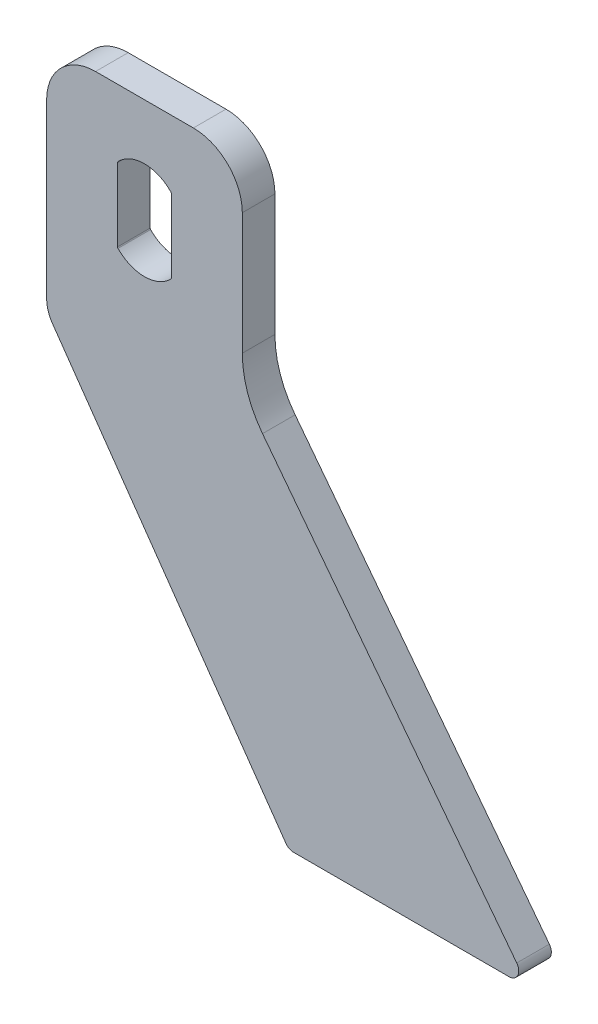
ISO-10303-21;
HEADER;
FILE_DESCRIPTION(('STEP AP214'),'2;1');
FILE_NAME('part.step','',(''),(''),'','','');
FILE_SCHEMA(('AUTOMOTIVE_DESIGN { 1 0 10303 214 1 1 1 1 }'));
ENDSEC;
DATA;
#1=APPLICATION_CONTEXT('core data for automotive mechanical design processes');
#2=APPLICATION_PROTOCOL_DEFINITION('international standard','automotive_design',2000,#1);
#3=PRODUCT_CONTEXT('',#1,'mechanical');
#4=PRODUCT('Part','Part','',(#3));
#5=PRODUCT_RELATED_PRODUCT_CATEGORY('part','',(#4));
#6=PRODUCT_DEFINITION_FORMATION('','',#4);
#7=PRODUCT_DEFINITION_CONTEXT('part definition',#1,'design');
#8=PRODUCT_DEFINITION('design','',#6,#7);
#9=PRODUCT_DEFINITION_SHAPE('','',#8);
#10=(LENGTH_UNIT() NAMED_UNIT(*) SI_UNIT(.MILLI.,.METRE.));
#11=(NAMED_UNIT(*) PLANE_ANGLE_UNIT() SI_UNIT($,.RADIAN.));
#12=(NAMED_UNIT(*) SI_UNIT($,.STERADIAN.) SOLID_ANGLE_UNIT());
#13=UNCERTAINTY_MEASURE_WITH_UNIT(LENGTH_MEASURE(1.E-05),#10,'distance_accuracy_value','');
#14=(GEOMETRIC_REPRESENTATION_CONTEXT(3) GLOBAL_UNCERTAINTY_ASSIGNED_CONTEXT((#13)) GLOBAL_UNIT_ASSIGNED_CONTEXT((#10,
#11,#12)) REPRESENTATION_CONTEXT('',''));
#15=CARTESIAN_POINT('',(0.,0.,0.));
#16=DIRECTION('',(0.,0.,1.));
#17=DIRECTION('',(1.,0.,0.));
#18=AXIS2_PLACEMENT_3D('',#15,#16,#17);
#19=CARTESIAN_POINT('',(-15.,17.,10.));
#20=DIRECTION('',(0.,0.,1.));
#21=DIRECTION('',(1.,0.,0.));
#22=AXIS2_PLACEMENT_3D('',#19,#20,#21);
#23=PLANE('',#22);
#24=CARTESIAN_POINT('',(-15.,17.,10.));
#25=DIRECTION('',(0.,0.,1.));
#26=DIRECTION('',(1.,0.,0.));
#27=AXIS2_PLACEMENT_3D('',#24,#25,#26);
#28=CIRCLE('',#27,15.);
#29=CARTESIAN_POINT('',(-15.,32.,10.));
#30=VERTEX_POINT('',#29);
#31=CARTESIAN_POINT('',(-30.,17.,10.));
#32=VERTEX_POINT('',#31);
#33=EDGE_CURVE('E238',#30,#32,#28,.T.);
#34=ORIENTED_EDGE('',*,*,#33,.T.);
#35=DIRECTION('',(0.,-1.,0.));
#36=VECTOR('',#35,1.);
#37=CARTESIAN_POINT('',(-30.,17.,10.));
#38=LINE('',#37,#36);
#39=CARTESIAN_POINT('',(-30.,-35.8470121112102,10.));
#40=VERTEX_POINT('',#39);
#41=EDGE_CURVE('E241',#32,#40,#38,.T.);
#42=ORIENTED_EDGE('',*,*,#41,.T.);
#43=CARTESIAN_POINT('',(-20.,-35.8470121112102,10.));
#44=DIRECTION('',(0.,0.,1.));
#45=DIRECTION('',(1.,0.,0.));
#46=AXIS2_PLACEMENT_3D('',#43,#44,#45);
#47=CIRCLE('',#46,10.);
#48=CARTESIAN_POINT('',(-28.1915204428899,-41.5827764747206,10.));
#49=VERTEX_POINT('',#48);
#50=EDGE_CURVE('E244',#40,#49,#47,.T.);
#51=ORIENTED_EDGE('',*,*,#50,.T.);
#52=DIRECTION('',(0.573576436351047,-0.819152044288991,0.));
#53=VECTOR('',#52,1.);
#54=CARTESIAN_POINT('',(-28.1915204428899,-41.5827764747206,10.));
#55=LINE('',#54,#53);
#56=CARTESIAN_POINT('',(43.3262440690177,-143.720729309053,10.));
#57=VERTEX_POINT('',#56);
#58=EDGE_CURVE('E246',#49,#57,#55,.T.);
#59=ORIENTED_EDGE('',*,*,#58,.T.);
#60=CARTESIAN_POINT('',(45.7837002018847,-142.,10.));
#61=DIRECTION('',(0.,0.,1.));
#62=DIRECTION('',(-1.,0.,0.));
#63=AXIS2_PLACEMENT_3D('',#60,#61,#62);
#64=CIRCLE('',#63,3.);
#65=CARTESIAN_POINT('',(45.7837002018847,-145.,10.));
#66=VERTEX_POINT('',#65);
#67=EDGE_CURVE('E248',#57,#66,#64,.T.);
#68=ORIENTED_EDGE('',*,*,#67,.T.);
#69=DIRECTION('',(1.,0.,0.));
#70=VECTOR('',#69,1.);
#71=CARTESIAN_POINT('',(45.7837002018847,-145.,10.));
#72=LINE('',#71,#70);
#73=CARTESIAN_POINT('',(111.775541917624,-145.,10.));
#74=VERTEX_POINT('',#73);
#75=EDGE_CURVE('E250',#66,#74,#72,.T.);
#76=ORIENTED_EDGE('',*,*,#75,.T.);
#77=CARTESIAN_POINT('',(111.775541917624,-142.,10.));
#78=DIRECTION('',(0.,0.,1.));
#79=DIRECTION('',(1.,0.,0.));
#80=AXIS2_PLACEMENT_3D('',#77,#78,#79);
#81=CIRCLE('',#80,3.);
#82=CARTESIAN_POINT('',(114.155601938497,-140.173715712974,10.));
#83=VERTEX_POINT('',#82);
#84=EDGE_CURVE('E252',#74,#83,#81,.T.);
#85=ORIENTED_EDGE('',*,*,#84,.T.);
#86=DIRECTION('',(-0.608761429008722,0.793353340291234,0.));
#87=VECTOR('',#86,1.);
#88=CARTESIAN_POINT('',(36.199399791263,-38.5792151043604,10.));
#89=LINE('',#88,#87);
#90=CARTESIAN_POINT('',(36.199399791263,-38.5792151043604,10.));
#91=VERTEX_POINT('',#90);
#92=EDGE_CURVE('E254',#83,#91,#89,.T.);
#93=ORIENTED_EDGE('',*,*,#92,.T.);
#94=CARTESIAN_POINT('',(60.,-20.3163722340987,10.));
#95=DIRECTION('',(0.,0.,-1.));
#96=DIRECTION('',(1.,0.,0.));
#97=AXIS2_PLACEMENT_3D('',#94,#95,#96);
#98=CIRCLE('',#97,30.);
#99=CARTESIAN_POINT('',(30.,-20.3163722340987,10.));
#100=VERTEX_POINT('',#99);
#101=EDGE_CURVE('E256',#91,#100,#98,.T.);
#102=ORIENTED_EDGE('',*,*,#101,.T.);
#103=DIRECTION('',(0.,1.,0.));
#104=VECTOR('',#103,1.);
#105=CARTESIAN_POINT('',(30.,17.,10.));
#106=LINE('',#105,#104);
#107=CARTESIAN_POINT('',(30.,17.,10.));
#108=VERTEX_POINT('',#107);
#109=EDGE_CURVE('E258',#100,#108,#106,.T.);
#110=ORIENTED_EDGE('',*,*,#109,.T.);
#111=CARTESIAN_POINT('',(15.,17.,10.));
#112=DIRECTION('',(0.,0.,1.));
#113=DIRECTION('',(-1.,0.,0.));
#114=AXIS2_PLACEMENT_3D('',#111,#112,#113);
#115=CIRCLE('',#114,15.);
#116=CARTESIAN_POINT('',(15.,32.,10.));
#117=VERTEX_POINT('',#116);
#118=EDGE_CURVE('E260',#108,#117,#115,.T.);
#119=ORIENTED_EDGE('',*,*,#118,.T.);
#120=DIRECTION('',(-1.,0.,0.));
#121=VECTOR('',#120,1.);
#122=CARTESIAN_POINT('',(15.,32.,10.));
#123=LINE('',#122,#121);
#124=EDGE_CURVE('E262',#117,#30,#123,.T.);
#125=ORIENTED_EDGE('',*,*,#124,.T.);
#126=EDGE_LOOP('',(#34,#42,#51,#59,#68,#76,#85,#93,#102,#110,#119,#125));
#127=FACE_BOUND('',#126,.T.);
#128=CARTESIAN_POINT('',(0.,3.75,10.));
#129=DIRECTION('',(0.,0.,1.));
#130=DIRECTION('',(1.,0.,0.));
#131=AXIS2_PLACEMENT_3D('',#128,#129,#130);
#132=CIRCLE('',#131,11.25);
#133=CARTESIAN_POINT('',(8.11046511627907,11.5463360367304,10.));
#134=VERTEX_POINT('',#133);
#135=CARTESIAN_POINT('',(-8.11046511627906,11.5463360367304,10.));
#136=VERTEX_POINT('',#135);
#137=EDGE_CURVE('E181',#134,#136,#132,.T.);
#138=ORIENTED_EDGE('',*,*,#137,.F.);
#139=CARTESIAN_POINT('',(7.75,11.1998322128757,10.));
#140=DIRECTION('',(0.,0.,1.));
#141=DIRECTION('',(1.,0.,0.));
#142=AXIS2_PLACEMENT_3D('',#139,#140,#141);
#143=CIRCLE('',#142,0.500000000000002);
#144=CARTESIAN_POINT('',(8.25,11.1998322128757,10.));
#145=VERTEX_POINT('',#144);
#146=EDGE_CURVE('E173',#145,#134,#143,.T.);
#147=ORIENTED_EDGE('',*,*,#146,.F.);
#148=DIRECTION('',(0.,1.,0.));
#149=VECTOR('',#148,1.);
#150=CARTESIAN_POINT('',(8.25,-11.1998322128757,10.));
#151=LINE('',#150,#149);
#152=CARTESIAN_POINT('',(8.25,-11.1998322128757,10.));
#153=VERTEX_POINT('',#152);
#154=EDGE_CURVE('E206',#153,#145,#151,.T.);
#155=ORIENTED_EDGE('',*,*,#154,.F.);
#156=CARTESIAN_POINT('',(7.75,-11.1998322128757,10.));
#157=DIRECTION('',(0.,0.,1.));
#158=DIRECTION('',(1.,0.,0.));
#159=AXIS2_PLACEMENT_3D('',#156,#157,#158);
#160=CIRCLE('',#159,0.500000000000002);
#161=CARTESIAN_POINT('',(8.11046511627907,-11.5463360367304,10.));
#162=VERTEX_POINT('',#161);
#163=EDGE_CURVE('E204',#162,#153,#160,.T.);
#164=ORIENTED_EDGE('',*,*,#163,.F.);
#165=CARTESIAN_POINT('',(0.,-3.75,10.));
#166=DIRECTION('',(0.,0.,1.));
#167=DIRECTION('',(-1.,0.,0.));
#168=AXIS2_PLACEMENT_3D('',#165,#166,#167);
#169=CIRCLE('',#168,11.25);
#170=CARTESIAN_POINT('',(-8.11046511627906,-11.5463360367304,10.));
#171=VERTEX_POINT('',#170);
#172=EDGE_CURVE('E202',#171,#162,#169,.T.);
#173=ORIENTED_EDGE('',*,*,#172,.F.);
#174=CARTESIAN_POINT('',(-7.75,-11.1998322128757,10.));
#175=DIRECTION('',(0.,0.,1.));
#176=DIRECTION('',(-1.,0.,0.));
#177=AXIS2_PLACEMENT_3D('',#174,#175,#176);
#178=CIRCLE('',#177,0.499999999999999);
#179=CARTESIAN_POINT('',(-8.25,-11.1998322128757,10.));
#180=VERTEX_POINT('',#179);
#181=EDGE_CURVE('E200',#180,#171,#178,.T.);
#182=ORIENTED_EDGE('',*,*,#181,.F.);
#183=DIRECTION('',(0.,-1.,0.));
#184=VECTOR('',#183,1.);
#185=CARTESIAN_POINT('',(-8.25,-11.1998322128757,10.));
#186=LINE('',#185,#184);
#187=CARTESIAN_POINT('',(-8.25,11.1998322128757,10.));
#188=VERTEX_POINT('',#187);
#189=EDGE_CURVE('E196',#188,#180,#186,.T.);
#190=ORIENTED_EDGE('',*,*,#189,.F.);
#191=CARTESIAN_POINT('',(-7.75,11.1998322128757,10.));
#192=DIRECTION('',(0.,0.,1.));
#193=DIRECTION('',(-1.,0.,0.));
#194=AXIS2_PLACEMENT_3D('',#191,#192,#193);
#195=CIRCLE('',#194,0.499999999999999);
#196=EDGE_CURVE('E194',#136,#188,#195,.T.);
#197=ORIENTED_EDGE('',*,*,#196,.F.);
#198=EDGE_LOOP('',(#138,#147,#155,#164,#173,#182,#190,#197));
#199=FACE_BOUND('',#198,.T.);
#200=ADVANCED_FACE('F36',(#127,#199),#23,.T.);
#201=CARTESIAN_POINT('',(-15.,17.,0.));
#202=DIRECTION('',(0.,0.,1.));
#203=DIRECTION('',(1.,0.,0.));
#204=AXIS2_PLACEMENT_3D('',#201,#202,#203);
#205=PLANE('',#204);
#206=CARTESIAN_POINT('',(-15.,17.,0.));
#207=DIRECTION('',(0.,0.,1.));
#208=DIRECTION('',(1.,0.,0.));
#209=AXIS2_PLACEMENT_3D('',#206,#207,#208);
#210=CIRCLE('',#209,15.);
#211=CARTESIAN_POINT('',(-15.,32.,0.));
#212=VERTEX_POINT('',#211);
#213=CARTESIAN_POINT('',(-30.,17.,0.));
#214=VERTEX_POINT('',#213);
#215=EDGE_CURVE('E189',#212,#214,#210,.T.);
#216=ORIENTED_EDGE('',*,*,#215,.F.);
#217=DIRECTION('',(-1.,0.,0.));
#218=VECTOR('',#217,1.);
#219=CARTESIAN_POINT('',(15.,32.,0.));
#220=LINE('',#219,#218);
#221=CARTESIAN_POINT('',(15.,32.,0.));
#222=VERTEX_POINT('',#221);
#223=EDGE_CURVE('E242',#222,#212,#220,.T.);
#224=ORIENTED_EDGE('',*,*,#223,.F.);
#225=CARTESIAN_POINT('',(15.,17.,0.));
#226=DIRECTION('',(0.,0.,1.));
#227=DIRECTION('',(-1.,0.,0.));
#228=AXIS2_PLACEMENT_3D('',#225,#226,#227);
#229=CIRCLE('',#228,15.);
#230=CARTESIAN_POINT('',(30.,17.,0.));
#231=VERTEX_POINT('',#230);
#232=EDGE_CURVE('E285',#231,#222,#229,.T.);
#233=ORIENTED_EDGE('',*,*,#232,.F.);
#234=DIRECTION('',(0.,1.,0.));
#235=VECTOR('',#234,1.);
#236=CARTESIAN_POINT('',(30.,17.,0.));
#237=LINE('',#236,#235);
#238=CARTESIAN_POINT('',(30.,-20.3163722340987,0.));
#239=VERTEX_POINT('',#238);
#240=EDGE_CURVE('E283',#239,#231,#237,.T.);
#241=ORIENTED_EDGE('',*,*,#240,.F.);
#242=CARTESIAN_POINT('',(60.,-20.3163722340987,0.));
#243=DIRECTION('',(0.,0.,-1.));
#244=DIRECTION('',(1.,0.,0.));
#245=AXIS2_PLACEMENT_3D('',#242,#243,#244);
#246=CIRCLE('',#245,30.);
#247=CARTESIAN_POINT('',(36.199399791263,-38.5792151043604,0.));
#248=VERTEX_POINT('',#247);
#249=EDGE_CURVE('E281',#248,#239,#246,.T.);
#250=ORIENTED_EDGE('',*,*,#249,.F.);
#251=DIRECTION('',(-0.608761429008722,0.793353340291234,0.));
#252=VECTOR('',#251,1.);
#253=CARTESIAN_POINT('',(36.199399791263,-38.5792151043604,0.));
#254=LINE('',#253,#252);
#255=CARTESIAN_POINT('',(114.155601938497,-140.173715712974,0.));
#256=VERTEX_POINT('',#255);
#257=EDGE_CURVE('E279',#256,#248,#254,.T.);
#258=ORIENTED_EDGE('',*,*,#257,.F.);
#259=CARTESIAN_POINT('',(111.775541917624,-142.,0.));
#260=DIRECTION('',(0.,0.,1.));
#261=DIRECTION('',(1.,0.,0.));
#262=AXIS2_PLACEMENT_3D('',#259,#260,#261);
#263=CIRCLE('',#262,3.);
#264=CARTESIAN_POINT('',(111.775541917624,-145.,0.));
#265=VERTEX_POINT('',#264);
#266=EDGE_CURVE('E277',#265,#256,#263,.T.);
#267=ORIENTED_EDGE('',*,*,#266,.F.);
#268=DIRECTION('',(1.,0.,0.));
#269=VECTOR('',#268,1.);
#270=CARTESIAN_POINT('',(45.7837002018847,-145.,0.));
#271=LINE('',#270,#269);
#272=CARTESIAN_POINT('',(45.7837002018847,-145.,0.));
#273=VERTEX_POINT('',#272);
#274=EDGE_CURVE('E275',#273,#265,#271,.T.);
#275=ORIENTED_EDGE('',*,*,#274,.F.);
#276=CARTESIAN_POINT('',(45.7837002018847,-142.,0.));
#277=DIRECTION('',(0.,0.,1.));
#278=DIRECTION('',(-1.,0.,0.));
#279=AXIS2_PLACEMENT_3D('',#276,#277,#278);
#280=CIRCLE('',#279,3.);
#281=CARTESIAN_POINT('',(43.3262440690177,-143.720729309053,0.));
#282=VERTEX_POINT('',#281);
#283=EDGE_CURVE('E273',#282,#273,#280,.T.);
#284=ORIENTED_EDGE('',*,*,#283,.F.);
#285=DIRECTION('',(0.573576436351047,-0.819152044288991,0.));
#286=VECTOR('',#285,1.);
#287=CARTESIAN_POINT('',(-28.1915204428899,-41.5827764747206,0.));
#288=LINE('',#287,#286);
#289=CARTESIAN_POINT('',(-28.1915204428899,-41.5827764747206,0.));
#290=VERTEX_POINT('',#289);
#291=EDGE_CURVE('E271',#290,#282,#288,.T.);
#292=ORIENTED_EDGE('',*,*,#291,.F.);
#293=CARTESIAN_POINT('',(-20.,-35.8470121112102,0.));
#294=DIRECTION('',(0.,0.,1.));
#295=DIRECTION('',(1.,0.,0.));
#296=AXIS2_PLACEMENT_3D('',#293,#294,#295);
#297=CIRCLE('',#296,10.);
#298=CARTESIAN_POINT('',(-30.,-35.8470121112102,0.));
#299=VERTEX_POINT('',#298);
#300=EDGE_CURVE('E269',#299,#290,#297,.T.);
#301=ORIENTED_EDGE('',*,*,#300,.F.);
#302=DIRECTION('',(0.,-1.,0.));
#303=VECTOR('',#302,1.);
#304=CARTESIAN_POINT('',(-30.,17.,0.));
#305=LINE('',#304,#303);
#306=EDGE_CURVE('E267',#214,#299,#305,.T.);
#307=ORIENTED_EDGE('',*,*,#306,.F.);
#308=EDGE_LOOP('',(#216,#224,#233,#241,#250,#258,#267,#275,#284,#292,#301,#307));
#309=FACE_BOUND('',#308,.T.);
#310=CARTESIAN_POINT('',(7.75,11.1998322128757,0.));
#311=DIRECTION('',(0.,0.,1.));
#312=DIRECTION('',(1.,0.,0.));
#313=AXIS2_PLACEMENT_3D('',#310,#311,#312);
#314=CIRCLE('',#313,0.500000000000002);
#315=CARTESIAN_POINT('',(8.25,11.1998322128757,0.));
#316=VERTEX_POINT('',#315);
#317=CARTESIAN_POINT('',(8.11046511627907,11.5463360367304,0.));
#318=VERTEX_POINT('',#317);
#319=EDGE_CURVE('E59',#316,#318,#314,.T.);
#320=ORIENTED_EDGE('',*,*,#319,.T.);
#321=CARTESIAN_POINT('',(0.,3.75,0.));
#322=DIRECTION('',(0.,0.,1.));
#323=DIRECTION('',(1.,0.,0.));
#324=AXIS2_PLACEMENT_3D('',#321,#322,#323);
#325=CIRCLE('',#324,11.25);
#326=CARTESIAN_POINT('',(-8.11046511627906,11.5463360367304,0.));
#327=VERTEX_POINT('',#326);
#328=EDGE_CURVE('E188',#318,#327,#325,.T.);
#329=ORIENTED_EDGE('',*,*,#328,.T.);
#330=CARTESIAN_POINT('',(-7.75,11.1998322128757,0.));
#331=DIRECTION('',(0.,0.,1.));
#332=DIRECTION('',(-1.,0.,0.));
#333=AXIS2_PLACEMENT_3D('',#330,#331,#332);
#334=CIRCLE('',#333,0.499999999999999);
#335=CARTESIAN_POINT('',(-8.25,11.1998322128757,0.));
#336=VERTEX_POINT('',#335);
#337=EDGE_CURVE('E210',#327,#336,#334,.T.);
#338=ORIENTED_EDGE('',*,*,#337,.T.);
#339=DIRECTION('',(0.,-1.,0.));
#340=VECTOR('',#339,1.);
#341=CARTESIAN_POINT('',(-8.25,-11.1998322128757,0.));
#342=LINE('',#341,#340);
#343=CARTESIAN_POINT('',(-8.25,-11.1998322128757,0.));
#344=VERTEX_POINT('',#343);
#345=EDGE_CURVE('E213',#336,#344,#342,.T.);
#346=ORIENTED_EDGE('',*,*,#345,.T.);
#347=CARTESIAN_POINT('',(-7.75,-11.1998322128757,0.));
#348=DIRECTION('',(0.,0.,1.));
#349=DIRECTION('',(-1.,0.,0.));
#350=AXIS2_PLACEMENT_3D('',#347,#348,#349);
#351=CIRCLE('',#350,0.499999999999999);
#352=CARTESIAN_POINT('',(-8.11046511627906,-11.5463360367304,0.));
#353=VERTEX_POINT('',#352);
#354=EDGE_CURVE('E216',#344,#353,#351,.T.);
#355=ORIENTED_EDGE('',*,*,#354,.T.);
#356=CARTESIAN_POINT('',(0.,-3.75,0.));
#357=DIRECTION('',(0.,0.,1.));
#358=DIRECTION('',(-1.,0.,0.));
#359=AXIS2_PLACEMENT_3D('',#356,#357,#358);
#360=CIRCLE('',#359,11.25);
#361=CARTESIAN_POINT('',(8.11046511627907,-11.5463360367304,0.));
#362=VERTEX_POINT('',#361);
#363=EDGE_CURVE('E219',#353,#362,#360,.T.);
#364=ORIENTED_EDGE('',*,*,#363,.T.);
#365=CARTESIAN_POINT('',(7.75,-11.1998322128757,0.));
#366=DIRECTION('',(0.,0.,1.));
#367=DIRECTION('',(1.,0.,0.));
#368=AXIS2_PLACEMENT_3D('',#365,#366,#367);
#369=CIRCLE('',#368,0.500000000000002);
#370=CARTESIAN_POINT('',(8.25,-11.1998322128757,0.));
#371=VERTEX_POINT('',#370);
#372=EDGE_CURVE('E222',#362,#371,#369,.T.);
#373=ORIENTED_EDGE('',*,*,#372,.T.);
#374=DIRECTION('',(0.,1.,0.));
#375=VECTOR('',#374,1.);
#376=CARTESIAN_POINT('',(8.25,-11.1998322128757,0.));
#377=LINE('',#376,#375);
#378=EDGE_CURVE('E182',#371,#316,#377,.T.);
#379=ORIENTED_EDGE('',*,*,#378,.T.);
#380=EDGE_LOOP('',(#320,#329,#338,#346,#355,#364,#373,#379));
#381=FACE_BOUND('',#380,.T.);
#382=ADVANCED_FACE('F327',(#309,#381),#205,.F.);
#383=CARTESIAN_POINT('',(-15.,17.,10.));
#384=DIRECTION('',(0.,0.,-1.));
#385=DIRECTION('',(-1.,0.,0.));
#386=AXIS2_PLACEMENT_3D('',#383,#384,#385);
#387=CYLINDRICAL_SURFACE('',#386,15.);
#388=ORIENTED_EDGE('',*,*,#215,.T.);
#389=DIRECTION('',(0.,0.,-1.));
#390=VECTOR('',#389,1.);
#391=CARTESIAN_POINT('',(-30.,17.,10.));
#392=LINE('',#391,#390);
#393=EDGE_CURVE('E11',#32,#214,#392,.T.);
#394=ORIENTED_EDGE('',*,*,#393,.F.);
#395=ORIENTED_EDGE('',*,*,#33,.F.);
#396=DIRECTION('',(0.,0.,-1.));
#397=VECTOR('',#396,1.);
#398=CARTESIAN_POINT('',(-15.,32.,10.));
#399=LINE('',#398,#397);
#400=EDGE_CURVE('E264',#30,#212,#399,.T.);
#401=ORIENTED_EDGE('',*,*,#400,.T.);
#402=EDGE_LOOP('',(#388,#394,#395,#401));
#403=FACE_BOUND('',#402,.T.);
#404=ADVANCED_FACE('F38',(#403),#387,.T.);
#405=CARTESIAN_POINT('',(-30.,17.,10.));
#406=DIRECTION('',(1.,0.,0.));
#407=DIRECTION('',(0.,1.,0.));
#408=AXIS2_PLACEMENT_3D('',#405,#406,#407);
#409=PLANE('',#408);
#410=ORIENTED_EDGE('',*,*,#306,.T.);
#411=DIRECTION('',(0.,0.,-1.));
#412=VECTOR('',#411,1.);
#413=CARTESIAN_POINT('',(-30.,-35.8470121112102,10.));
#414=LINE('',#413,#412);
#415=EDGE_CURVE('E44',#40,#299,#414,.T.);
#416=ORIENTED_EDGE('',*,*,#415,.F.);
#417=ORIENTED_EDGE('',*,*,#41,.F.);
#418=ORIENTED_EDGE('',*,*,#393,.T.);
#419=EDGE_LOOP('',(#410,#416,#417,#418));
#420=FACE_BOUND('',#419,.T.);
#421=ADVANCED_FACE('F344',(#420),#409,.F.);
#422=CARTESIAN_POINT('',(-20.,-35.8470121112102,10.));
#423=DIRECTION('',(0.,0.,-1.));
#424=DIRECTION('',(-1.,0.,0.));
#425=AXIS2_PLACEMENT_3D('',#422,#423,#424);
#426=CYLINDRICAL_SURFACE('',#425,10.);
#427=ORIENTED_EDGE('',*,*,#300,.T.);
#428=DIRECTION('',(0.,0.,-1.));
#429=VECTOR('',#428,1.);
#430=CARTESIAN_POINT('',(-28.1915204428899,-41.5827764747206,10.));
#431=LINE('',#430,#429);
#432=EDGE_CURVE('E314',#49,#290,#431,.T.);
#433=ORIENTED_EDGE('',*,*,#432,.F.);
#434=ORIENTED_EDGE('',*,*,#50,.F.);
#435=ORIENTED_EDGE('',*,*,#415,.T.);
#436=EDGE_LOOP('',(#427,#433,#434,#435));
#437=FACE_BOUND('',#436,.T.);
#438=ADVANCED_FACE('F321',(#437),#426,.T.);
#439=CARTESIAN_POINT('',(-28.1915204428899,-41.5827764747206,10.));
#440=DIRECTION('',(0.819152044288991,0.573576436351047,0.));
#441=DIRECTION('',(-0.573576436351047,0.819152044288991,0.));
#442=AXIS2_PLACEMENT_3D('',#439,#440,#441);
#443=PLANE('',#442);
#444=ORIENTED_EDGE('',*,*,#291,.T.);
#445=DIRECTION('',(0.,0.,-1.));
#446=VECTOR('',#445,1.);
#447=CARTESIAN_POINT('',(43.3262440690177,-143.720729309053,10.));
#448=LINE('',#447,#446);
#449=EDGE_CURVE('E311',#57,#282,#448,.T.);
#450=ORIENTED_EDGE('',*,*,#449,.F.);
#451=ORIENTED_EDGE('',*,*,#58,.F.);
#452=ORIENTED_EDGE('',*,*,#432,.T.);
#453=EDGE_LOOP('',(#444,#450,#451,#452));
#454=FACE_BOUND('',#453,.T.);
#455=ADVANCED_FACE('F333',(#454),#443,.F.);
#456=CARTESIAN_POINT('',(45.7837002018847,-142.,10.));
#457=DIRECTION('',(0.,0.,-1.));
#458=DIRECTION('',(-1.,0.,0.));
#459=AXIS2_PLACEMENT_3D('',#456,#457,#458);
#460=CYLINDRICAL_SURFACE('',#459,3.);
#461=ORIENTED_EDGE('',*,*,#283,.T.);
#462=DIRECTION('',(0.,0.,-1.));
#463=VECTOR('',#462,1.);
#464=CARTESIAN_POINT('',(45.7837002018847,-145.,10.));
#465=LINE('',#464,#463);
#466=EDGE_CURVE('E308',#66,#273,#465,.T.);
#467=ORIENTED_EDGE('',*,*,#466,.F.);
#468=ORIENTED_EDGE('',*,*,#67,.F.);
#469=ORIENTED_EDGE('',*,*,#449,.T.);
#470=EDGE_LOOP('',(#461,#467,#468,#469));
#471=FACE_BOUND('',#470,.T.);
#472=ADVANCED_FACE('F337',(#471),#460,.T.);
#473=CARTESIAN_POINT('',(45.7837002018847,-145.,10.));
#474=DIRECTION('',(0.,1.,0.));
#475=DIRECTION('',(0.,0.,1.));
#476=AXIS2_PLACEMENT_3D('',#473,#474,#475);
#477=PLANE('',#476);
#478=ORIENTED_EDGE('',*,*,#274,.T.);
#479=DIRECTION('',(0.,0.,-1.));
#480=VECTOR('',#479,1.);
#481=CARTESIAN_POINT('',(111.775541917624,-145.,10.));
#482=LINE('',#481,#480);
#483=EDGE_CURVE('E305',#74,#265,#482,.T.);
#484=ORIENTED_EDGE('',*,*,#483,.F.);
#485=ORIENTED_EDGE('',*,*,#75,.F.);
#486=ORIENTED_EDGE('',*,*,#466,.T.);
#487=EDGE_LOOP('',(#478,#484,#485,#486));
#488=FACE_BOUND('',#487,.T.);
#489=ADVANCED_FACE('F377',(#488),#477,.F.);
#490=CARTESIAN_POINT('',(111.775541917624,-142.,10.));
#491=DIRECTION('',(0.,0.,-1.));
#492=DIRECTION('',(-1.,0.,0.));
#493=AXIS2_PLACEMENT_3D('',#490,#491,#492);
#494=CYLINDRICAL_SURFACE('',#493,3.);
#495=ORIENTED_EDGE('',*,*,#266,.T.);
#496=DIRECTION('',(0.,0.,-1.));
#497=VECTOR('',#496,1.);
#498=CARTESIAN_POINT('',(114.155601938497,-140.173715712974,10.));
#499=LINE('',#498,#497);
#500=EDGE_CURVE('E302',#83,#256,#499,.T.);
#501=ORIENTED_EDGE('',*,*,#500,.F.);
#502=ORIENTED_EDGE('',*,*,#84,.F.);
#503=ORIENTED_EDGE('',*,*,#483,.T.);
#504=EDGE_LOOP('',(#495,#501,#502,#503));
#505=FACE_BOUND('',#504,.T.);
#506=ADVANCED_FACE('F375',(#505),#494,.T.);
#507=CARTESIAN_POINT('',(36.199399791263,-38.5792151043604,10.));
#508=DIRECTION('',(-0.793353340291234,-0.608761429008723,0.));
#509=DIRECTION('',(0.608761429008723,-0.793353340291234,0.));
#510=AXIS2_PLACEMENT_3D('',#507,#508,#509);
#511=PLANE('',#510);
#512=ORIENTED_EDGE('',*,*,#257,.T.);
#513=DIRECTION('',(0.,0.,-1.));
#514=VECTOR('',#513,1.);
#515=CARTESIAN_POINT('',(36.199399791263,-38.5792151043604,10.));
#516=LINE('',#515,#514);
#517=EDGE_CURVE('E299',#91,#248,#516,.T.);
#518=ORIENTED_EDGE('',*,*,#517,.F.);
#519=ORIENTED_EDGE('',*,*,#92,.F.);
#520=ORIENTED_EDGE('',*,*,#500,.T.);
#521=EDGE_LOOP('',(#512,#518,#519,#520));
#522=FACE_BOUND('',#521,.T.);
#523=ADVANCED_FACE('F371',(#522),#511,.F.);
#524=CARTESIAN_POINT('',(60.,-20.3163722340987,10.));
#525=DIRECTION('',(0.,0.,-1.));
#526=DIRECTION('',(-1.,0.,0.));
#527=AXIS2_PLACEMENT_3D('',#524,#525,#526);
#528=CYLINDRICAL_SURFACE('',#527,30.);
#529=ORIENTED_EDGE('',*,*,#249,.T.);
#530=DIRECTION('',(0.,0.,-1.));
#531=VECTOR('',#530,1.);
#532=CARTESIAN_POINT('',(30.,-20.3163722340987,10.));
#533=LINE('',#532,#531);
#534=EDGE_CURVE('E296',#100,#239,#533,.T.);
#535=ORIENTED_EDGE('',*,*,#534,.F.);
#536=ORIENTED_EDGE('',*,*,#101,.F.);
#537=ORIENTED_EDGE('',*,*,#517,.T.);
#538=EDGE_LOOP('',(#529,#535,#536,#537));
#539=FACE_BOUND('',#538,.T.);
#540=ADVANCED_FACE('F366',(#539),#528,.F.);
#541=CARTESIAN_POINT('',(30.,17.,10.));
#542=DIRECTION('',(-1.,0.,0.));
#543=DIRECTION('',(0.,-1.,0.));
#544=AXIS2_PLACEMENT_3D('',#541,#542,#543);
#545=PLANE('',#544);
#546=ORIENTED_EDGE('',*,*,#240,.T.);
#547=DIRECTION('',(0.,0.,-1.));
#548=VECTOR('',#547,1.);
#549=CARTESIAN_POINT('',(30.,17.,10.));
#550=LINE('',#549,#548);
#551=EDGE_CURVE('E293',#108,#231,#550,.T.);
#552=ORIENTED_EDGE('',*,*,#551,.F.);
#553=ORIENTED_EDGE('',*,*,#109,.F.);
#554=ORIENTED_EDGE('',*,*,#534,.T.);
#555=EDGE_LOOP('',(#546,#552,#553,#554));
#556=FACE_BOUND('',#555,.T.);
#557=ADVANCED_FACE('F360',(#556),#545,.F.);
#558=CARTESIAN_POINT('',(15.,17.,10.));
#559=DIRECTION('',(0.,0.,-1.));
#560=DIRECTION('',(-1.,0.,0.));
#561=AXIS2_PLACEMENT_3D('',#558,#559,#560);
#562=CYLINDRICAL_SURFACE('',#561,15.);
#563=ORIENTED_EDGE('',*,*,#232,.T.);
#564=DIRECTION('',(0.,0.,-1.));
#565=VECTOR('',#564,1.);
#566=CARTESIAN_POINT('',(15.,32.,10.));
#567=LINE('',#566,#565);
#568=EDGE_CURVE('E290',#117,#222,#567,.T.);
#569=ORIENTED_EDGE('',*,*,#568,.F.);
#570=ORIENTED_EDGE('',*,*,#118,.F.);
#571=ORIENTED_EDGE('',*,*,#551,.T.);
#572=EDGE_LOOP('',(#563,#569,#570,#571));
#573=FACE_BOUND('',#572,.T.);
#574=ADVANCED_FACE('F356',(#573),#562,.T.);
#575=CARTESIAN_POINT('',(15.,32.,10.));
#576=DIRECTION('',(0.,-1.,0.));
#577=DIRECTION('',(1.,0.,0.));
#578=AXIS2_PLACEMENT_3D('',#575,#576,#577);
#579=PLANE('',#578);
#580=ORIENTED_EDGE('',*,*,#223,.T.);
#581=ORIENTED_EDGE('',*,*,#400,.F.);
#582=ORIENTED_EDGE('',*,*,#124,.F.);
#583=ORIENTED_EDGE('',*,*,#568,.T.);
#584=EDGE_LOOP('',(#580,#581,#582,#583));
#585=FACE_BOUND('',#584,.T.);
#586=ADVANCED_FACE('F351',(#585),#579,.F.);
#587=CARTESIAN_POINT('',(7.75,11.1998322128757,10.));
#588=DIRECTION('',(0.,0.,-1.));
#589=DIRECTION('',(-1.,0.,0.));
#590=AXIS2_PLACEMENT_3D('',#587,#588,#589);
#591=CYLINDRICAL_SURFACE('',#590,0.500000000000002);
#592=ORIENTED_EDGE('',*,*,#319,.F.);
#593=DIRECTION('',(0.,0.,-1.));
#594=VECTOR('',#593,1.);
#595=CARTESIAN_POINT('',(8.25,11.1998322128757,10.));
#596=LINE('',#595,#594);
#597=EDGE_CURVE('E177',#145,#316,#596,.T.);
#598=ORIENTED_EDGE('',*,*,#597,.F.);
#599=ORIENTED_EDGE('',*,*,#146,.T.);
#600=DIRECTION('',(0.,0.,-1.));
#601=VECTOR('',#600,1.);
#602=CARTESIAN_POINT('',(8.11046511627907,11.5463360367304,10.));
#603=LINE('',#602,#601);
#604=EDGE_CURVE('E176',#134,#318,#603,.T.);
#605=ORIENTED_EDGE('',*,*,#604,.T.);
#606=EDGE_LOOP('',(#592,#598,#599,#605));
#607=FACE_BOUND('',#606,.T.);
#608=ADVANCED_FACE('F175',(#607),#591,.F.);
#609=CARTESIAN_POINT('',(0.,3.75,10.));
#610=DIRECTION('',(0.,0.,-1.));
#611=DIRECTION('',(-1.,0.,0.));
#612=AXIS2_PLACEMENT_3D('',#609,#610,#611);
#613=CYLINDRICAL_SURFACE('',#612,11.25);
#614=ORIENTED_EDGE('',*,*,#328,.F.);
#615=ORIENTED_EDGE('',*,*,#604,.F.);
#616=ORIENTED_EDGE('',*,*,#137,.T.);
#617=DIRECTION('',(0.,0.,-1.));
#618=VECTOR('',#617,1.);
#619=CARTESIAN_POINT('',(-8.11046511627906,11.5463360367304,10.));
#620=LINE('',#619,#618);
#621=EDGE_CURVE('E190',#136,#327,#620,.T.);
#622=ORIENTED_EDGE('',*,*,#621,.T.);
#623=EDGE_LOOP('',(#614,#615,#616,#622));
#624=FACE_BOUND('',#623,.T.);
#625=ADVANCED_FACE('F185',(#624),#613,.F.);
#626=CARTESIAN_POINT('',(-7.75,11.1998322128757,10.));
#627=DIRECTION('',(0.,0.,-1.));
#628=DIRECTION('',(-1.,0.,0.));
#629=AXIS2_PLACEMENT_3D('',#626,#627,#628);
#630=CYLINDRICAL_SURFACE('',#629,0.499999999999999);
#631=ORIENTED_EDGE('',*,*,#337,.F.);
#632=ORIENTED_EDGE('',*,*,#621,.F.);
#633=ORIENTED_EDGE('',*,*,#196,.T.);
#634=DIRECTION('',(0.,0.,-1.));
#635=VECTOR('',#634,1.);
#636=CARTESIAN_POINT('',(-8.25,11.1998322128757,10.));
#637=LINE('',#636,#635);
#638=EDGE_CURVE('E235',#188,#336,#637,.T.);
#639=ORIENTED_EDGE('',*,*,#638,.T.);
#640=EDGE_LOOP('',(#631,#632,#633,#639));
#641=FACE_BOUND('',#640,.T.);
#642=ADVANCED_FACE('F435',(#641),#630,.F.);
#643=CARTESIAN_POINT('',(-8.25,-11.1998322128757,10.));
#644=DIRECTION('',(1.,0.,0.));
#645=DIRECTION('',(0.,0.,-1.));
#646=AXIS2_PLACEMENT_3D('',#643,#644,#645);
#647=PLANE('',#646);
#648=ORIENTED_EDGE('',*,*,#345,.F.);
#649=ORIENTED_EDGE('',*,*,#638,.F.);
#650=ORIENTED_EDGE('',*,*,#189,.T.);
#651=DIRECTION('',(0.,0.,-1.));
#652=VECTOR('',#651,1.);
#653=CARTESIAN_POINT('',(-8.25,-11.1998322128757,10.));
#654=LINE('',#653,#652);
#655=EDGE_CURVE('E233',#180,#344,#654,.T.);
#656=ORIENTED_EDGE('',*,*,#655,.T.);
#657=EDGE_LOOP('',(#648,#649,#650,#656));
#658=FACE_BOUND('',#657,.T.);
#659=ADVANCED_FACE('F441',(#658),#647,.T.);
#660=CARTESIAN_POINT('',(-7.75,-11.1998322128757,10.));
#661=DIRECTION('',(0.,0.,-1.));
#662=DIRECTION('',(-1.,0.,0.));
#663=AXIS2_PLACEMENT_3D('',#660,#661,#662);
#664=CYLINDRICAL_SURFACE('',#663,0.499999999999999);
#665=ORIENTED_EDGE('',*,*,#354,.F.);
#666=ORIENTED_EDGE('',*,*,#655,.F.);
#667=ORIENTED_EDGE('',*,*,#181,.T.);
#668=DIRECTION('',(0.,0.,-1.));
#669=VECTOR('',#668,1.);
#670=CARTESIAN_POINT('',(-8.11046511627906,-11.5463360367304,10.));
#671=LINE('',#670,#669);
#672=EDGE_CURVE('E231',#171,#353,#671,.T.);
#673=ORIENTED_EDGE('',*,*,#672,.T.);
#674=EDGE_LOOP('',(#665,#666,#667,#673));
#675=FACE_BOUND('',#674,.T.);
#676=ADVANCED_FACE('F449',(#675),#664,.F.);
#677=CARTESIAN_POINT('',(0.,-3.75,10.));
#678=DIRECTION('',(0.,0.,-1.));
#679=DIRECTION('',(-1.,0.,0.));
#680=AXIS2_PLACEMENT_3D('',#677,#678,#679);
#681=CYLINDRICAL_SURFACE('',#680,11.25);
#682=ORIENTED_EDGE('',*,*,#363,.F.);
#683=ORIENTED_EDGE('',*,*,#672,.F.);
#684=ORIENTED_EDGE('',*,*,#172,.T.);
#685=DIRECTION('',(0.,0.,-1.));
#686=VECTOR('',#685,1.);
#687=CARTESIAN_POINT('',(8.11046511627907,-11.5463360367304,10.));
#688=LINE('',#687,#686);
#689=EDGE_CURVE('E229',#162,#362,#688,.T.);
#690=ORIENTED_EDGE('',*,*,#689,.T.);
#691=EDGE_LOOP('',(#682,#683,#684,#690));
#692=FACE_BOUND('',#691,.T.);
#693=ADVANCED_FACE('F457',(#692),#681,.F.);
#694=CARTESIAN_POINT('',(7.75,-11.1998322128757,10.));
#695=DIRECTION('',(0.,0.,-1.));
#696=DIRECTION('',(-1.,0.,0.));
#697=AXIS2_PLACEMENT_3D('',#694,#695,#696);
#698=CYLINDRICAL_SURFACE('',#697,0.500000000000002);
#699=ORIENTED_EDGE('',*,*,#372,.F.);
#700=ORIENTED_EDGE('',*,*,#689,.F.);
#701=ORIENTED_EDGE('',*,*,#163,.T.);
#702=DIRECTION('',(0.,0.,-1.));
#703=VECTOR('',#702,1.);
#704=CARTESIAN_POINT('',(8.25,-11.1998322128757,10.));
#705=LINE('',#704,#703);
#706=EDGE_CURVE('E51',#153,#371,#705,.T.);
#707=ORIENTED_EDGE('',*,*,#706,.T.);
#708=EDGE_LOOP('',(#699,#700,#701,#707));
#709=FACE_BOUND('',#708,.T.);
#710=ADVANCED_FACE('F465',(#709),#698,.F.);
#711=CARTESIAN_POINT('',(8.25,-11.1998322128757,10.));
#712=DIRECTION('',(-1.,0.,0.));
#713=DIRECTION('',(0.,0.,1.));
#714=AXIS2_PLACEMENT_3D('',#711,#712,#713);
#715=PLANE('',#714);
#716=ORIENTED_EDGE('',*,*,#378,.F.);
#717=ORIENTED_EDGE('',*,*,#706,.F.);
#718=ORIENTED_EDGE('',*,*,#154,.T.);
#719=ORIENTED_EDGE('',*,*,#597,.T.);
#720=EDGE_LOOP('',(#716,#717,#718,#719));
#721=FACE_BOUND('',#720,.T.);
#722=ADVANCED_FACE('F473',(#721),#715,.T.);
#723=CLOSED_SHELL('',(#200,#382,#404,#421,#438,#455,#472,#489,#506,#523,#540,#557,#574,#586,
#608,#625,#642,#659,#676,#693,#710,#722));
#724=MANIFOLD_SOLID_BREP('B2',#723);
#725=ADVANCED_BREP_SHAPE_REPRESENTATION('',(#18,#724),#14);
#726=SHAPE_DEFINITION_REPRESENTATION(#9,#725);
ENDSEC;
END-ISO-10303-21;
